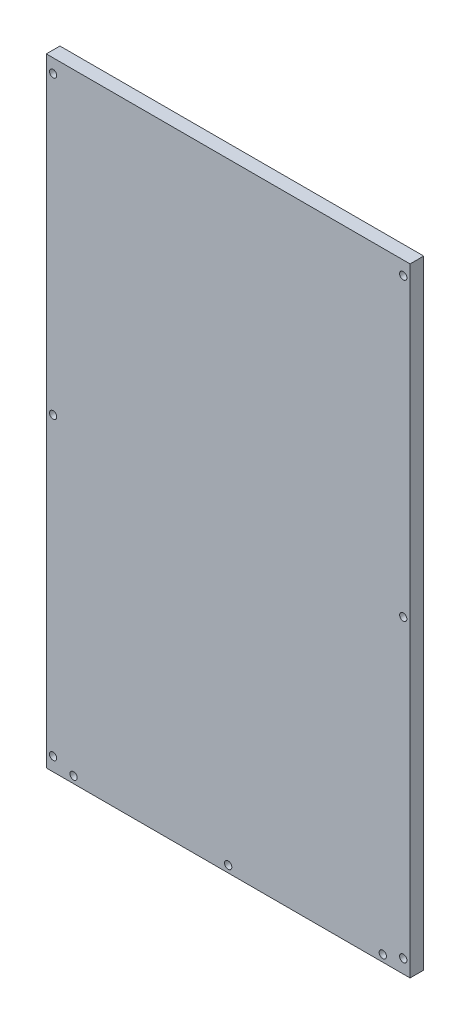
ISO-10303-21;
HEADER;
FILE_DESCRIPTION(('STEP AP214'),'2;1');
FILE_NAME('part.step','',(''),(''),'','','');
FILE_SCHEMA(('AUTOMOTIVE_DESIGN { 1 0 10303 214 1 1 1 1 }'));
ENDSEC;
DATA;
#1=APPLICATION_CONTEXT('core data for automotive mechanical design processes');
#2=APPLICATION_PROTOCOL_DEFINITION('international standard','automotive_design',2000,#1);
#3=PRODUCT_CONTEXT('',#1,'mechanical');
#4=PRODUCT('Part','Part','',(#3));
#5=PRODUCT_RELATED_PRODUCT_CATEGORY('part','',(#4));
#6=PRODUCT_DEFINITION_FORMATION('','',#4);
#7=PRODUCT_DEFINITION_CONTEXT('part definition',#1,'design');
#8=PRODUCT_DEFINITION('design','',#6,#7);
#9=PRODUCT_DEFINITION_SHAPE('','',#8);
#10=(LENGTH_UNIT() NAMED_UNIT(*) SI_UNIT(.MILLI.,.METRE.));
#11=(NAMED_UNIT(*) PLANE_ANGLE_UNIT() SI_UNIT($,.RADIAN.));
#12=(NAMED_UNIT(*) SI_UNIT($,.STERADIAN.) SOLID_ANGLE_UNIT());
#13=UNCERTAINTY_MEASURE_WITH_UNIT(LENGTH_MEASURE(1.E-05),#10,'distance_accuracy_value','');
#14=(GEOMETRIC_REPRESENTATION_CONTEXT(3) GLOBAL_UNCERTAINTY_ASSIGNED_CONTEXT((#13)) GLOBAL_UNIT_ASSIGNED_CONTEXT((#10,
#11,#12)) REPRESENTATION_CONTEXT('',''));
#15=CARTESIAN_POINT('',(0.,0.,0.));
#16=DIRECTION('',(0.,0.,1.));
#17=DIRECTION('',(1.,0.,0.));
#18=AXIS2_PLACEMENT_3D('',#15,#16,#17);
#19=CARTESIAN_POINT('',(200.,-340.,15.));
#20=DIRECTION('',(-1.,0.,0.));
#21=DIRECTION('',(0.,0.,1.));
#22=AXIS2_PLACEMENT_3D('',#19,#20,#21);
#23=PLANE('',#22);
#24=DIRECTION('',(0.,1.,0.));
#25=VECTOR('',#24,1.);
#26=CARTESIAN_POINT('',(200.,-340.,0.));
#27=LINE('',#26,#25);
#28=CARTESIAN_POINT('',(200.,-340.,0.));
#29=VERTEX_POINT('',#28);
#30=CARTESIAN_POINT('',(200.,340.,0.));
#31=VERTEX_POINT('',#30);
#32=EDGE_CURVE('E102',#29,#31,#27,.T.);
#33=ORIENTED_EDGE('',*,*,#32,.T.);
#34=DIRECTION('',(0.,0.,-1.));
#35=VECTOR('',#34,1.);
#36=CARTESIAN_POINT('',(200.,340.,15.));
#37=LINE('',#36,#35);
#38=CARTESIAN_POINT('',(200.,340.,15.));
#39=VERTEX_POINT('',#38);
#40=EDGE_CURVE('E11',#39,#31,#37,.T.);
#41=ORIENTED_EDGE('',*,*,#40,.F.);
#42=DIRECTION('',(0.,1.,0.));
#43=VECTOR('',#42,1.);
#44=CARTESIAN_POINT('',(200.,-340.,15.));
#45=LINE('',#44,#43);
#46=CARTESIAN_POINT('',(200.,-340.,15.));
#47=VERTEX_POINT('',#46);
#48=EDGE_CURVE('E90',#47,#39,#45,.T.);
#49=ORIENTED_EDGE('',*,*,#48,.F.);
#50=DIRECTION('',(0.,0.,-1.));
#51=VECTOR('',#50,1.);
#52=CARTESIAN_POINT('',(200.,-340.,15.));
#53=LINE('',#52,#51);
#54=EDGE_CURVE('E98',#47,#29,#53,.T.);
#55=ORIENTED_EDGE('',*,*,#54,.T.);
#56=EDGE_LOOP('',(#33,#41,#49,#55));
#57=FACE_BOUND('',#56,.T.);
#58=ADVANCED_FACE('F39',(#57),#23,.F.);
#59=CARTESIAN_POINT('',(-200.,340.,15.));
#60=DIRECTION('',(0.,-1.,0.));
#61=DIRECTION('',(0.,0.,-1.));
#62=AXIS2_PLACEMENT_3D('',#59,#60,#61);
#63=PLANE('',#62);
#64=DIRECTION('',(-1.,0.,0.));
#65=VECTOR('',#64,1.);
#66=CARTESIAN_POINT('',(-200.,340.,0.));
#67=LINE('',#66,#65);
#68=CARTESIAN_POINT('',(-200.,340.,0.));
#69=VERTEX_POINT('',#68);
#70=EDGE_CURVE('E94',#31,#69,#67,.T.);
#71=ORIENTED_EDGE('',*,*,#70,.T.);
#72=DIRECTION('',(0.,0.,-1.));
#73=VECTOR('',#72,1.);
#74=CARTESIAN_POINT('',(-200.,340.,15.));
#75=LINE('',#74,#73);
#76=CARTESIAN_POINT('',(-200.,340.,15.));
#77=VERTEX_POINT('',#76);
#78=EDGE_CURVE('E47',#77,#69,#75,.T.);
#79=ORIENTED_EDGE('',*,*,#78,.F.);
#80=DIRECTION('',(-1.,0.,0.));
#81=VECTOR('',#80,1.);
#82=CARTESIAN_POINT('',(-200.,340.,15.));
#83=LINE('',#82,#81);
#84=EDGE_CURVE('E85',#39,#77,#83,.T.);
#85=ORIENTED_EDGE('',*,*,#84,.F.);
#86=ORIENTED_EDGE('',*,*,#40,.T.);
#87=EDGE_LOOP('',(#71,#79,#85,#86));
#88=FACE_BOUND('',#87,.T.);
#89=ADVANCED_FACE('F93',(#88),#63,.F.);
#90=CARTESIAN_POINT('',(-200.,-340.,15.));
#91=DIRECTION('',(1.,0.,0.));
#92=DIRECTION('',(0.,0.,-1.));
#93=AXIS2_PLACEMENT_3D('',#90,#91,#92);
#94=PLANE('',#93);
#95=DIRECTION('',(0.,-1.,0.));
#96=VECTOR('',#95,1.);
#97=CARTESIAN_POINT('',(-200.,-340.,0.));
#98=LINE('',#97,#96);
#99=CARTESIAN_POINT('',(-200.,-340.,0.));
#100=VERTEX_POINT('',#99);
#101=EDGE_CURVE('E72',#69,#100,#98,.T.);
#102=ORIENTED_EDGE('',*,*,#101,.T.);
#103=DIRECTION('',(0.,0.,-1.));
#104=VECTOR('',#103,1.);
#105=CARTESIAN_POINT('',(-200.,-340.,15.));
#106=LINE('',#105,#104);
#107=CARTESIAN_POINT('',(-200.,-340.,15.));
#108=VERTEX_POINT('',#107);
#109=EDGE_CURVE('E95',#108,#100,#106,.T.);
#110=ORIENTED_EDGE('',*,*,#109,.F.);
#111=DIRECTION('',(0.,-1.,0.));
#112=VECTOR('',#111,1.);
#113=CARTESIAN_POINT('',(-200.,-340.,15.));
#114=LINE('',#113,#112);
#115=EDGE_CURVE('E88',#77,#108,#114,.T.);
#116=ORIENTED_EDGE('',*,*,#115,.F.);
#117=ORIENTED_EDGE('',*,*,#78,.T.);
#118=EDGE_LOOP('',(#102,#110,#116,#117));
#119=FACE_BOUND('',#118,.T.);
#120=ADVANCED_FACE('F96',(#119),#94,.F.);
#121=CARTESIAN_POINT('',(-200.,-340.,15.));
#122=DIRECTION('',(0.,1.,0.));
#123=DIRECTION('',(0.,0.,1.));
#124=AXIS2_PLACEMENT_3D('',#121,#122,#123);
#125=PLANE('',#124);
#126=DIRECTION('',(1.,0.,0.));
#127=VECTOR('',#126,1.);
#128=CARTESIAN_POINT('',(-200.,-340.,0.));
#129=LINE('',#128,#127);
#130=EDGE_CURVE('E78',#100,#29,#129,.T.);
#131=ORIENTED_EDGE('',*,*,#130,.T.);
#132=ORIENTED_EDGE('',*,*,#54,.F.);
#133=DIRECTION('',(1.,0.,0.));
#134=VECTOR('',#133,1.);
#135=CARTESIAN_POINT('',(-200.,-340.,15.));
#136=LINE('',#135,#134);
#137=EDGE_CURVE('E55',#108,#47,#136,.T.);
#138=ORIENTED_EDGE('',*,*,#137,.F.);
#139=ORIENTED_EDGE('',*,*,#109,.T.);
#140=EDGE_LOOP('',(#131,#132,#138,#139));
#141=FACE_BOUND('',#140,.T.);
#142=ADVANCED_FACE('F110',(#141),#125,.F.);
#143=CARTESIAN_POINT('',(0.,0.,15.));
#144=DIRECTION('',(0.,0.,-1.));
#145=DIRECTION('',(-1.,0.,0.));
#146=AXIS2_PLACEMENT_3D('',#143,#144,#145);
#147=PLANE('',#146);
#148=CARTESIAN_POINT('',(-170.,-332.5,15.));
#149=DIRECTION('',(0.,0.,1.));
#150=DIRECTION('',(1.,0.,0.));
#151=AXIS2_PLACEMENT_3D('',#148,#149,#150);
#152=CIRCLE('',#151,3.99999999999999);
#153=CARTESIAN_POINT('',(-166.,-332.5,15.));
#154=VERTEX_POINT('',#153);
#155=EDGE_CURVE('E166',#154,#154,#152,.T.);
#156=ORIENTED_EDGE('',*,*,#155,.F.);
#157=EDGE_LOOP('',(#156));
#158=FACE_BOUND('',#157,.T.);
#159=CARTESIAN_POINT('',(0.,-332.5,15.));
#160=DIRECTION('',(0.,0.,1.));
#161=DIRECTION('',(1.,0.,0.));
#162=AXIS2_PLACEMENT_3D('',#159,#160,#161);
#163=CIRCLE('',#162,3.99999999999999);
#164=CARTESIAN_POINT('',(4.00000000000002,-332.5,15.));
#165=VERTEX_POINT('',#164);
#166=EDGE_CURVE('E160',#165,#165,#163,.T.);
#167=ORIENTED_EDGE('',*,*,#166,.F.);
#168=EDGE_LOOP('',(#167));
#169=FACE_BOUND('',#168,.T.);
#170=CARTESIAN_POINT('',(170.,-332.5,15.));
#171=DIRECTION('',(0.,0.,1.));
#172=DIRECTION('',(1.,0.,0.));
#173=AXIS2_PLACEMENT_3D('',#170,#171,#172);
#174=CIRCLE('',#173,3.99999999999999);
#175=CARTESIAN_POINT('',(174.,-332.5,15.));
#176=VERTEX_POINT('',#175);
#177=EDGE_CURVE('E152',#176,#176,#174,.T.);
#178=ORIENTED_EDGE('',*,*,#177,.F.);
#179=EDGE_LOOP('',(#178));
#180=FACE_BOUND('',#179,.T.);
#181=CARTESIAN_POINT('',(-192.5,0.,15.));
#182=DIRECTION('',(0.,0.,-1.));
#183=DIRECTION('',(-1.,0.,0.));
#184=AXIS2_PLACEMENT_3D('',#181,#182,#183);
#185=CIRCLE('',#184,3.99999999999999);
#186=CARTESIAN_POINT('',(-196.5,0.,15.));
#187=VERTEX_POINT('',#186);
#188=EDGE_CURVE('E147',#187,#187,#185,.F.);
#189=ORIENTED_EDGE('',*,*,#188,.F.);
#190=EDGE_LOOP('',(#189));
#191=FACE_BOUND('',#190,.T.);
#192=CARTESIAN_POINT('',(-192.5,-325.,15.));
#193=DIRECTION('',(0.,0.,-1.));
#194=DIRECTION('',(-1.,0.,0.));
#195=AXIS2_PLACEMENT_3D('',#192,#193,#194);
#196=CIRCLE('',#195,3.99999999999999);
#197=CARTESIAN_POINT('',(-196.5,-325.,15.));
#198=VERTEX_POINT('',#197);
#199=EDGE_CURVE('E140',#198,#198,#196,.F.);
#200=ORIENTED_EDGE('',*,*,#199,.F.);
#201=EDGE_LOOP('',(#200));
#202=FACE_BOUND('',#201,.T.);
#203=CARTESIAN_POINT('',(-192.5,325.,15.));
#204=DIRECTION('',(0.,0.,-1.));
#205=DIRECTION('',(-1.,0.,0.));
#206=AXIS2_PLACEMENT_3D('',#203,#204,#205);
#207=CIRCLE('',#206,3.99999999999999);
#208=CARTESIAN_POINT('',(-196.5,325.,15.));
#209=VERTEX_POINT('',#208);
#210=EDGE_CURVE('E134',#209,#209,#207,.F.);
#211=ORIENTED_EDGE('',*,*,#210,.F.);
#212=EDGE_LOOP('',(#211));
#213=FACE_BOUND('',#212,.T.);
#214=CARTESIAN_POINT('',(192.5,-325.,15.));
#215=DIRECTION('',(0.,0.,1.));
#216=DIRECTION('',(1.,0.,0.));
#217=AXIS2_PLACEMENT_3D('',#214,#215,#216);
#218=CIRCLE('',#217,3.99999999999999);
#219=CARTESIAN_POINT('',(196.5,-325.,15.));
#220=VERTEX_POINT('',#219);
#221=EDGE_CURVE('E130',#220,#220,#218,.F.);
#222=ORIENTED_EDGE('',*,*,#221,.T.);
#223=EDGE_LOOP('',(#222));
#224=FACE_BOUND('',#223,.T.);
#225=CARTESIAN_POINT('',(192.5,0.,15.));
#226=DIRECTION('',(0.,0.,1.));
#227=DIRECTION('',(1.,0.,0.));
#228=AXIS2_PLACEMENT_3D('',#225,#226,#227);
#229=CIRCLE('',#228,3.99999999999999);
#230=CARTESIAN_POINT('',(196.5,0.,15.));
#231=VERTEX_POINT('',#230);
#232=EDGE_CURVE('E124',#231,#231,#229,.F.);
#233=ORIENTED_EDGE('',*,*,#232,.T.);
#234=EDGE_LOOP('',(#233));
#235=FACE_BOUND('',#234,.T.);
#236=CARTESIAN_POINT('',(192.5,325.,15.));
#237=DIRECTION('',(0.,0.,1.));
#238=DIRECTION('',(1.,0.,0.));
#239=AXIS2_PLACEMENT_3D('',#236,#237,#238);
#240=CIRCLE('',#239,3.99999999999999);
#241=CARTESIAN_POINT('',(196.5,325.,15.));
#242=VERTEX_POINT('',#241);
#243=EDGE_CURVE('E116',#242,#242,#240,.F.);
#244=ORIENTED_EDGE('',*,*,#243,.T.);
#245=EDGE_LOOP('',(#244));
#246=FACE_BOUND('',#245,.T.);
#247=ORIENTED_EDGE('',*,*,#48,.T.);
#248=ORIENTED_EDGE('',*,*,#84,.T.);
#249=ORIENTED_EDGE('',*,*,#115,.T.);
#250=ORIENTED_EDGE('',*,*,#137,.T.);
#251=EDGE_LOOP('',(#247,#248,#249,#250));
#252=FACE_BOUND('',#251,.T.);
#253=ADVANCED_FACE('F86',(#158,#169,#180,#191,#202,#213,#224,#235,#246,#252),#147,.F.);
#254=CARTESIAN_POINT('',(0.,0.,0.));
#255=DIRECTION('',(0.,0.,-1.));
#256=DIRECTION('',(-1.,0.,0.));
#257=AXIS2_PLACEMENT_3D('',#254,#255,#256);
#258=PLANE('',#257);
#259=ORIENTED_EDGE('',*,*,#32,.F.);
#260=ORIENTED_EDGE('',*,*,#130,.F.);
#261=ORIENTED_EDGE('',*,*,#101,.F.);
#262=ORIENTED_EDGE('',*,*,#70,.F.);
#263=EDGE_LOOP('',(#259,#260,#261,#262));
#264=FACE_BOUND('',#263,.T.);
#265=ADVANCED_FACE('F113',(#264),#258,.T.);
#266=CARTESIAN_POINT('',(192.5,325.,5.));
#267=DIRECTION('',(0.,0.,1.));
#268=DIRECTION('',(1.,0.,0.));
#269=AXIS2_PLACEMENT_3D('',#266,#267,#268);
#270=CYLINDRICAL_SURFACE('',#269,3.99999999999999);
#271=CARTESIAN_POINT('',(192.5,325.,5.));
#272=DIRECTION('',(0.,0.,1.));
#273=DIRECTION('',(1.,0.,0.));
#274=AXIS2_PLACEMENT_3D('',#271,#272,#273);
#275=CIRCLE('',#274,3.99999999999999);
#276=CARTESIAN_POINT('',(196.5,325.,5.));
#277=VERTEX_POINT('',#276);
#278=EDGE_CURVE('E105',#277,#277,#275,.F.);
#279=ORIENTED_EDGE('',*,*,#278,.T.);
#280=EDGE_LOOP('',(#279));
#281=FACE_BOUND('',#280,.T.);
#282=ORIENTED_EDGE('',*,*,#243,.F.);
#283=EDGE_LOOP('',(#282));
#284=FACE_BOUND('',#283,.T.);
#285=ADVANCED_FACE('F191',(#281,#284),#270,.F.);
#286=CARTESIAN_POINT('',(0.,0.,5.));
#287=DIRECTION('',(0.,0.,1.));
#288=DIRECTION('',(1.,0.,0.));
#289=AXIS2_PLACEMENT_3D('',#286,#287,#288);
#290=PLANE('',#289);
#291=ORIENTED_EDGE('',*,*,#278,.F.);
#292=EDGE_LOOP('',(#291));
#293=FACE_BOUND('',#292,.T.);
#294=ADVANCED_FACE('F193',(#293),#290,.T.);
#295=CARTESIAN_POINT('',(192.5,0.,5.));
#296=DIRECTION('',(0.,0.,1.));
#297=DIRECTION('',(1.,0.,0.));
#298=AXIS2_PLACEMENT_3D('',#295,#296,#297);
#299=CYLINDRICAL_SURFACE('',#298,3.99999999999999);
#300=CARTESIAN_POINT('',(192.5,0.,5.));
#301=DIRECTION('',(0.,0.,1.));
#302=DIRECTION('',(1.,0.,0.));
#303=AXIS2_PLACEMENT_3D('',#300,#301,#302);
#304=CIRCLE('',#303,3.99999999999999);
#305=CARTESIAN_POINT('',(196.5,0.,5.));
#306=VERTEX_POINT('',#305);
#307=EDGE_CURVE('E119',#306,#306,#304,.F.);
#308=ORIENTED_EDGE('',*,*,#307,.T.);
#309=EDGE_LOOP('',(#308));
#310=FACE_BOUND('',#309,.T.);
#311=ORIENTED_EDGE('',*,*,#232,.F.);
#312=EDGE_LOOP('',(#311));
#313=FACE_BOUND('',#312,.T.);
#314=ADVANCED_FACE('F200',(#310,#313),#299,.F.);
#315=CARTESIAN_POINT('',(0.,-325.,5.));
#316=DIRECTION('',(0.,0.,1.));
#317=DIRECTION('',(1.,0.,0.));
#318=AXIS2_PLACEMENT_3D('',#315,#316,#317);
#319=PLANE('',#318);
#320=ORIENTED_EDGE('',*,*,#307,.F.);
#321=EDGE_LOOP('',(#320));
#322=FACE_BOUND('',#321,.T.);
#323=ADVANCED_FACE('F250',(#322),#319,.T.);
#324=CARTESIAN_POINT('',(192.5,-325.,5.));
#325=DIRECTION('',(0.,0.,1.));
#326=DIRECTION('',(1.,0.,0.));
#327=AXIS2_PLACEMENT_3D('',#324,#325,#326);
#328=CYLINDRICAL_SURFACE('',#327,3.99999999999999);
#329=CARTESIAN_POINT('',(192.5,-325.,5.));
#330=DIRECTION('',(0.,0.,1.));
#331=DIRECTION('',(1.,0.,0.));
#332=AXIS2_PLACEMENT_3D('',#329,#330,#331);
#333=CIRCLE('',#332,3.99999999999999);
#334=CARTESIAN_POINT('',(196.5,-325.,5.));
#335=VERTEX_POINT('',#334);
#336=EDGE_CURVE('E127',#335,#335,#333,.F.);
#337=ORIENTED_EDGE('',*,*,#336,.T.);
#338=EDGE_LOOP('',(#337));
#339=FACE_BOUND('',#338,.T.);
#340=ORIENTED_EDGE('',*,*,#221,.F.);
#341=EDGE_LOOP('',(#340));
#342=FACE_BOUND('',#341,.T.);
#343=ADVANCED_FACE('F261',(#339,#342),#328,.F.);
#344=CARTESIAN_POINT('',(0.,-650.,5.));
#345=DIRECTION('',(0.,0.,1.));
#346=DIRECTION('',(1.,0.,0.));
#347=AXIS2_PLACEMENT_3D('',#344,#345,#346);
#348=PLANE('',#347);
#349=ORIENTED_EDGE('',*,*,#336,.F.);
#350=EDGE_LOOP('',(#349));
#351=FACE_BOUND('',#350,.T.);
#352=ADVANCED_FACE('F272',(#351),#348,.T.);
#353=CARTESIAN_POINT('',(-192.5,325.,5.));
#354=DIRECTION('',(0.,0.,1.));
#355=DIRECTION('',(1.,0.,0.));
#356=AXIS2_PLACEMENT_3D('',#353,#354,#355);
#357=CYLINDRICAL_SURFACE('',#356,3.99999999999999);
#358=CARTESIAN_POINT('',(-192.5,325.,5.));
#359=DIRECTION('',(0.,0.,-1.));
#360=DIRECTION('',(-1.,0.,0.));
#361=AXIS2_PLACEMENT_3D('',#358,#359,#360);
#362=CIRCLE('',#361,3.99999999999999);
#363=CARTESIAN_POINT('',(-196.5,325.,5.));
#364=VERTEX_POINT('',#363);
#365=EDGE_CURVE('E133',#364,#364,#362,.F.);
#366=ORIENTED_EDGE('',*,*,#365,.F.);
#367=EDGE_LOOP('',(#366));
#368=FACE_BOUND('',#367,.T.);
#369=ORIENTED_EDGE('',*,*,#210,.T.);
#370=EDGE_LOOP('',(#369));
#371=FACE_BOUND('',#370,.T.);
#372=ADVANCED_FACE('F283',(#368,#371),#357,.F.);
#373=CARTESIAN_POINT('',(0.,0.,5.));
#374=DIRECTION('',(0.,0.,1.));
#375=DIRECTION('',(-1.,0.,0.));
#376=AXIS2_PLACEMENT_3D('',#373,#374,#375);
#377=PLANE('',#376);
#378=ORIENTED_EDGE('',*,*,#365,.T.);
#379=EDGE_LOOP('',(#378));
#380=FACE_BOUND('',#379,.T.);
#381=ADVANCED_FACE('F294',(#380),#377,.T.);
#382=CARTESIAN_POINT('',(-192.5,-325.,5.));
#383=DIRECTION('',(0.,0.,1.));
#384=DIRECTION('',(1.,0.,0.));
#385=AXIS2_PLACEMENT_3D('',#382,#383,#384);
#386=CYLINDRICAL_SURFACE('',#385,3.99999999999999);
#387=CARTESIAN_POINT('',(-192.5,-325.,5.));
#388=DIRECTION('',(0.,0.,-1.));
#389=DIRECTION('',(-1.,0.,0.));
#390=AXIS2_PLACEMENT_3D('',#387,#388,#389);
#391=CIRCLE('',#390,3.99999999999999);
#392=CARTESIAN_POINT('',(-196.5,-325.,5.));
#393=VERTEX_POINT('',#392);
#394=EDGE_CURVE('E143',#393,#393,#391,.F.);
#395=ORIENTED_EDGE('',*,*,#394,.F.);
#396=EDGE_LOOP('',(#395));
#397=FACE_BOUND('',#396,.T.);
#398=ORIENTED_EDGE('',*,*,#199,.T.);
#399=EDGE_LOOP('',(#398));
#400=FACE_BOUND('',#399,.T.);
#401=ADVANCED_FACE('F305',(#397,#400),#386,.F.);
#402=CARTESIAN_POINT('',(0.,-650.,5.));
#403=DIRECTION('',(0.,0.,1.));
#404=DIRECTION('',(-1.,0.,0.));
#405=AXIS2_PLACEMENT_3D('',#402,#403,#404);
#406=PLANE('',#405);
#407=ORIENTED_EDGE('',*,*,#394,.T.);
#408=EDGE_LOOP('',(#407));
#409=FACE_BOUND('',#408,.T.);
#410=ADVANCED_FACE('F316',(#409),#406,.T.);
#411=CARTESIAN_POINT('',(-192.5,0.,5.));
#412=DIRECTION('',(0.,0.,1.));
#413=DIRECTION('',(1.,0.,0.));
#414=AXIS2_PLACEMENT_3D('',#411,#412,#413);
#415=CYLINDRICAL_SURFACE('',#414,3.99999999999999);
#416=CARTESIAN_POINT('',(-192.5,0.,5.));
#417=DIRECTION('',(0.,0.,-1.));
#418=DIRECTION('',(-1.,0.,0.));
#419=AXIS2_PLACEMENT_3D('',#416,#417,#418);
#420=CIRCLE('',#419,3.99999999999999);
#421=CARTESIAN_POINT('',(-196.5,0.,5.));
#422=VERTEX_POINT('',#421);
#423=EDGE_CURVE('E137',#422,#422,#420,.F.);
#424=ORIENTED_EDGE('',*,*,#423,.F.);
#425=EDGE_LOOP('',(#424));
#426=FACE_BOUND('',#425,.T.);
#427=ORIENTED_EDGE('',*,*,#188,.T.);
#428=EDGE_LOOP('',(#427));
#429=FACE_BOUND('',#428,.T.);
#430=ADVANCED_FACE('F327',(#426,#429),#415,.F.);
#431=CARTESIAN_POINT('',(0.,-325.,5.));
#432=DIRECTION('',(0.,0.,1.));
#433=DIRECTION('',(-1.,0.,0.));
#434=AXIS2_PLACEMENT_3D('',#431,#432,#433);
#435=PLANE('',#434);
#436=ORIENTED_EDGE('',*,*,#423,.T.);
#437=EDGE_LOOP('',(#436));
#438=FACE_BOUND('',#437,.T.);
#439=ADVANCED_FACE('F338',(#438),#435,.T.);
#440=CARTESIAN_POINT('',(170.,-332.5,5.));
#441=DIRECTION('',(0.,0.,1.));
#442=DIRECTION('',(1.,0.,0.));
#443=AXIS2_PLACEMENT_3D('',#440,#441,#442);
#444=CYLINDRICAL_SURFACE('',#443,3.99999999999999);
#445=CARTESIAN_POINT('',(170.,-332.5,5.));
#446=DIRECTION('',(0.,0.,1.));
#447=DIRECTION('',(1.,0.,0.));
#448=AXIS2_PLACEMENT_3D('',#445,#446,#447);
#449=CIRCLE('',#448,3.99999999999999);
#450=CARTESIAN_POINT('',(174.,-332.5,5.));
#451=VERTEX_POINT('',#450);
#452=EDGE_CURVE('E144',#451,#451,#449,.T.);
#453=ORIENTED_EDGE('',*,*,#452,.F.);
#454=EDGE_LOOP('',(#453));
#455=FACE_BOUND('',#454,.T.);
#456=ORIENTED_EDGE('',*,*,#177,.T.);
#457=EDGE_LOOP('',(#456));
#458=FACE_BOUND('',#457,.T.);
#459=ADVANCED_FACE('F349',(#455,#458),#444,.F.);
#460=CARTESIAN_POINT('',(0.,0.,5.));
#461=DIRECTION('',(0.,0.,1.));
#462=DIRECTION('',(1.,0.,0.));
#463=AXIS2_PLACEMENT_3D('',#460,#461,#462);
#464=PLANE('',#463);
#465=ORIENTED_EDGE('',*,*,#452,.T.);
#466=EDGE_LOOP('',(#465));
#467=FACE_BOUND('',#466,.T.);
#468=ADVANCED_FACE('F359',(#467),#464,.T.);
#469=CARTESIAN_POINT('',(0.,-332.5,5.));
#470=DIRECTION('',(0.,0.,1.));
#471=DIRECTION('',(1.,0.,0.));
#472=AXIS2_PLACEMENT_3D('',#469,#470,#471);
#473=CYLINDRICAL_SURFACE('',#472,3.99999999999999);
#474=CARTESIAN_POINT('',(0.,-332.5,5.));
#475=DIRECTION('',(0.,0.,1.));
#476=DIRECTION('',(1.,0.,0.));
#477=AXIS2_PLACEMENT_3D('',#474,#475,#476);
#478=CIRCLE('',#477,3.99999999999999);
#479=CARTESIAN_POINT('',(4.00000000000002,-332.5,5.));
#480=VERTEX_POINT('',#479);
#481=EDGE_CURVE('E155',#480,#480,#478,.T.);
#482=ORIENTED_EDGE('',*,*,#481,.F.);
#483=EDGE_LOOP('',(#482));
#484=FACE_BOUND('',#483,.T.);
#485=ORIENTED_EDGE('',*,*,#166,.T.);
#486=EDGE_LOOP('',(#485));
#487=FACE_BOUND('',#486,.T.);
#488=ADVANCED_FACE('F369',(#484,#487),#473,.F.);
#489=CARTESIAN_POINT('',(-170.,0.,5.));
#490=DIRECTION('',(0.,0.,1.));
#491=DIRECTION('',(1.,0.,0.));
#492=AXIS2_PLACEMENT_3D('',#489,#490,#491);
#493=PLANE('',#492);
#494=ORIENTED_EDGE('',*,*,#481,.T.);
#495=EDGE_LOOP('',(#494));
#496=FACE_BOUND('',#495,.T.);
#497=ADVANCED_FACE('F380',(#496),#493,.T.);
#498=CARTESIAN_POINT('',(-170.,-332.5,5.));
#499=DIRECTION('',(0.,0.,1.));
#500=DIRECTION('',(1.,0.,0.));
#501=AXIS2_PLACEMENT_3D('',#498,#499,#500);
#502=CYLINDRICAL_SURFACE('',#501,3.99999999999999);
#503=CARTESIAN_POINT('',(-170.,-332.5,5.));
#504=DIRECTION('',(0.,0.,1.));
#505=DIRECTION('',(1.,0.,0.));
#506=AXIS2_PLACEMENT_3D('',#503,#504,#505);
#507=CIRCLE('',#506,3.99999999999999);
#508=CARTESIAN_POINT('',(-166.,-332.5,5.));
#509=VERTEX_POINT('',#508);
#510=EDGE_CURVE('E163',#509,#509,#507,.T.);
#511=ORIENTED_EDGE('',*,*,#510,.F.);
#512=EDGE_LOOP('',(#511));
#513=FACE_BOUND('',#512,.T.);
#514=ORIENTED_EDGE('',*,*,#155,.T.);
#515=EDGE_LOOP('',(#514));
#516=FACE_BOUND('',#515,.T.);
#517=ADVANCED_FACE('F170',(#513,#516),#502,.F.);
#518=CARTESIAN_POINT('',(-340.,0.,5.));
#519=DIRECTION('',(0.,0.,1.));
#520=DIRECTION('',(1.,0.,0.));
#521=AXIS2_PLACEMENT_3D('',#518,#519,#520);
#522=PLANE('',#521);
#523=ORIENTED_EDGE('',*,*,#510,.T.);
#524=EDGE_LOOP('',(#523));
#525=FACE_BOUND('',#524,.T.);
#526=ADVANCED_FACE('F394',(#525),#522,.T.);
#527=CLOSED_SHELL('',(#58,#89,#120,#142,#253,#265,#285,#294,#314,#323,#343,#352,#372,#381,#401,
#410,#430,#439,#459,#468,#488,#497,#517,#526));
#528=MANIFOLD_SOLID_BREP('B2',#527);
#529=ADVANCED_BREP_SHAPE_REPRESENTATION('',(#18,#528),#14);
#530=SHAPE_DEFINITION_REPRESENTATION(#9,#529);
ENDSEC;
END-ISO-10303-21;
